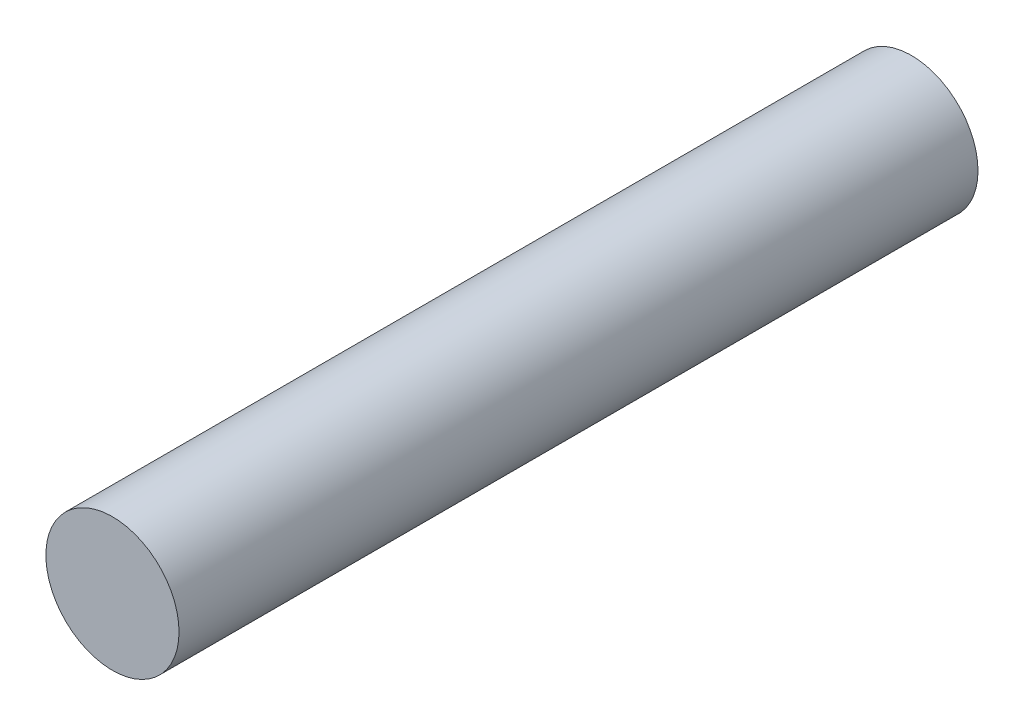
ISO-10303-21;
HEADER;
FILE_DESCRIPTION(('STEP AP214'),'2;1');
FILE_NAME('part.step','',(''),(''),'','','');
FILE_SCHEMA(('AUTOMOTIVE_DESIGN { 1 0 10303 214 1 1 1 1 }'));
ENDSEC;
DATA;
#1=APPLICATION_CONTEXT('core data for automotive mechanical design processes');
#2=APPLICATION_PROTOCOL_DEFINITION('international standard','automotive_design',2000,#1);
#3=PRODUCT_CONTEXT('',#1,'mechanical');
#4=PRODUCT('Part','Part','',(#3));
#5=PRODUCT_RELATED_PRODUCT_CATEGORY('part','',(#4));
#6=PRODUCT_DEFINITION_FORMATION('','',#4);
#7=PRODUCT_DEFINITION_CONTEXT('part definition',#1,'design');
#8=PRODUCT_DEFINITION('design','',#6,#7);
#9=PRODUCT_DEFINITION_SHAPE('','',#8);
#10=(LENGTH_UNIT() NAMED_UNIT(*) SI_UNIT(.MILLI.,.METRE.));
#11=(NAMED_UNIT(*) PLANE_ANGLE_UNIT() SI_UNIT($,.RADIAN.));
#12=(NAMED_UNIT(*) SI_UNIT($,.STERADIAN.) SOLID_ANGLE_UNIT());
#13=UNCERTAINTY_MEASURE_WITH_UNIT(LENGTH_MEASURE(1.E-05),#10,'distance_accuracy_value','');
#14=(GEOMETRIC_REPRESENTATION_CONTEXT(3) GLOBAL_UNCERTAINTY_ASSIGNED_CONTEXT((#13)) GLOBAL_UNIT_ASSIGNED_CONTEXT((#10,
#11,#12)) REPRESENTATION_CONTEXT('',''));
#15=CARTESIAN_POINT('',(0.,0.,0.));
#16=DIRECTION('',(0.,0.,1.));
#17=DIRECTION('',(1.,0.,0.));
#18=AXIS2_PLACEMENT_3D('',#15,#16,#17);
#19=CARTESIAN_POINT('',(0.,0.,3810.));
#20=DIRECTION('',(0.,0.,-1.));
#21=DIRECTION('',(-1.,0.,0.));
#22=AXIS2_PLACEMENT_3D('',#19,#20,#21);
#23=CYLINDRICAL_SURFACE('',#22,635.);
#24=CARTESIAN_POINT('',(0.,0.,3810.));
#25=DIRECTION('',(0.,0.,1.));
#26=DIRECTION('',(1.,0.,0.));
#27=AXIS2_PLACEMENT_3D('',#24,#25,#26);
#28=CIRCLE('',#27,635.);
#29=CARTESIAN_POINT('',(635.,0.,3810.));
#30=VERTEX_POINT('',#29);
#31=EDGE_CURVE('E10',#30,#30,#28,.T.);
#32=ORIENTED_EDGE('',*,*,#31,.F.);
#33=EDGE_LOOP('',(#32));
#34=FACE_BOUND('',#33,.T.);
#35=CARTESIAN_POINT('',(0.,0.,-3810.));
#36=DIRECTION('',(0.,0.,1.));
#37=DIRECTION('',(1.,0.,0.));
#38=AXIS2_PLACEMENT_3D('',#35,#36,#37);
#39=CIRCLE('',#38,635.);
#40=CARTESIAN_POINT('',(635.,0.,-3810.));
#41=VERTEX_POINT('',#40);
#42=EDGE_CURVE('E34',#41,#41,#39,.T.);
#43=ORIENTED_EDGE('',*,*,#42,.T.);
#44=EDGE_LOOP('',(#43));
#45=FACE_BOUND('',#44,.T.);
#46=ADVANCED_FACE('F31',(#34,#45),#23,.T.);
#47=CARTESIAN_POINT('',(0.,0.,3810.));
#48=DIRECTION('',(0.,0.,1.));
#49=DIRECTION('',(1.,0.,0.));
#50=AXIS2_PLACEMENT_3D('',#47,#48,#49);
#51=PLANE('',#50);
#52=ORIENTED_EDGE('',*,*,#31,.T.);
#53=EDGE_LOOP('',(#52));
#54=FACE_BOUND('',#53,.T.);
#55=ADVANCED_FACE('F46',(#54),#51,.T.);
#56=CARTESIAN_POINT('',(0.,0.,-3810.));
#57=DIRECTION('',(0.,0.,1.));
#58=DIRECTION('',(1.,0.,0.));
#59=AXIS2_PLACEMENT_3D('',#56,#57,#58);
#60=PLANE('',#59);
#61=ORIENTED_EDGE('',*,*,#42,.F.);
#62=EDGE_LOOP('',(#61));
#63=FACE_BOUND('',#62,.T.);
#64=ADVANCED_FACE('F44',(#63),#60,.F.);
#65=CLOSED_SHELL('',(#46,#55,#64));
#66=MANIFOLD_SOLID_BREP('B2',#65);
#67=ADVANCED_BREP_SHAPE_REPRESENTATION('',(#18,#66),#14);
#68=SHAPE_DEFINITION_REPRESENTATION(#9,#67);
ENDSEC;
END-ISO-10303-21;
